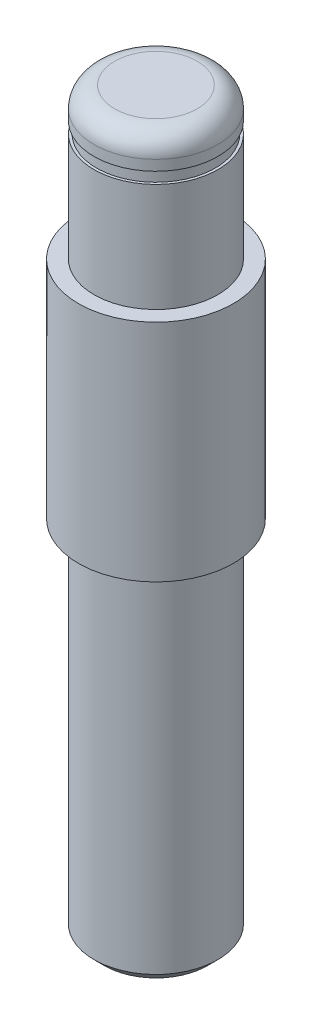
ISO-10303-21;
HEADER;
FILE_DESCRIPTION(('STEP AP214'),'2;1');
FILE_NAME('part.step','',(''),(''),'','','');
FILE_SCHEMA(('AUTOMOTIVE_DESIGN { 1 0 10303 214 1 1 1 1 }'));
ENDSEC;
DATA;
#1=APPLICATION_CONTEXT('core data for automotive mechanical design processes');
#2=APPLICATION_PROTOCOL_DEFINITION('international standard','automotive_design',2000,#1);
#3=PRODUCT_CONTEXT('',#1,'mechanical');
#4=PRODUCT('Part','Part','',(#3));
#5=PRODUCT_RELATED_PRODUCT_CATEGORY('part','',(#4));
#6=PRODUCT_DEFINITION_FORMATION('','',#4);
#7=PRODUCT_DEFINITION_CONTEXT('part definition',#1,'design');
#8=PRODUCT_DEFINITION('design','',#6,#7);
#9=PRODUCT_DEFINITION_SHAPE('','',#8);
#10=(LENGTH_UNIT() NAMED_UNIT(*) SI_UNIT(.MILLI.,.METRE.));
#11=(NAMED_UNIT(*) PLANE_ANGLE_UNIT() SI_UNIT($,.RADIAN.));
#12=(NAMED_UNIT(*) SI_UNIT($,.STERADIAN.) SOLID_ANGLE_UNIT());
#13=UNCERTAINTY_MEASURE_WITH_UNIT(LENGTH_MEASURE(1.E-05),#10,'distance_accuracy_value','');
#14=(GEOMETRIC_REPRESENTATION_CONTEXT(3) GLOBAL_UNCERTAINTY_ASSIGNED_CONTEXT((#13)) GLOBAL_UNIT_ASSIGNED_CONTEXT((#10,
#11,#12)) REPRESENTATION_CONTEXT('',''));
#15=CARTESIAN_POINT('',(0.,0.,0.));
#16=DIRECTION('',(0.,0.,1.));
#17=DIRECTION('',(1.,0.,0.));
#18=AXIS2_PLACEMENT_3D('',#15,#16,#17);
#19=CARTESIAN_POINT('',(0.,0.,0.));
#20=DIRECTION('',(0.,1.,0.));
#21=DIRECTION('',(-1.,0.,0.));
#22=AXIS2_PLACEMENT_3D('',#19,#20,#21);
#23=PLANE('',#22);
#24=CARTESIAN_POINT('',(0.,0.,0.));
#25=DIRECTION('',(0.,1.,0.));
#26=DIRECTION('',(-1.,0.,0.));
#27=AXIS2_PLACEMENT_3D('',#24,#25,#26);
#28=CIRCLE('',#27,5.);
#29=CARTESIAN_POINT('',(-5.,0.,0.));
#30=VERTEX_POINT('',#29);
#31=EDGE_CURVE('E70',#30,#30,#28,.T.);
#32=ORIENTED_EDGE('',*,*,#31,.F.);
#33=EDGE_LOOP('',(#32));
#34=FACE_BOUND('',#33,.T.);
#35=ADVANCED_FACE('F30',(#34),#23,.F.);
#36=CARTESIAN_POINT('',(4.00000000000001,71.4,0.));
#37=DIRECTION('',(0.,-1.,0.));
#38=DIRECTION('',(1.,0.,0.));
#39=AXIS2_PLACEMENT_3D('',#36,#37,#38);
#40=PLANE('',#39);
#41=CARTESIAN_POINT('',(0.,71.4,0.));
#42=DIRECTION('',(0.,1.,0.));
#43=DIRECTION('',(-1.,0.,0.));
#44=AXIS2_PLACEMENT_3D('',#41,#42,#43);
#45=CIRCLE('',#44,4.00000000000001);
#46=CARTESIAN_POINT('',(-4.00000000000001,71.4,0.));
#47=VERTEX_POINT('',#46);
#48=EDGE_CURVE('E10',#47,#47,#45,.T.);
#49=ORIENTED_EDGE('',*,*,#48,.T.);
#50=EDGE_LOOP('',(#49));
#51=FACE_BOUND('',#50,.T.);
#52=ADVANCED_FACE('F77',(#51),#40,.F.);
#53=CARTESIAN_POINT('',(0.,69.4,0.));
#54=DIRECTION('',(0.,1.,0.));
#55=DIRECTION('',(-1.,0.,0.));
#56=AXIS2_PLACEMENT_3D('',#53,#54,#55);
#57=TOROIDAL_SURFACE('',#56,4.00000000000001,2.);
#58=ORIENTED_EDGE('',*,*,#48,.F.);
#59=EDGE_LOOP('',(#58));
#60=FACE_BOUND('',#59,.T.);
#61=CARTESIAN_POINT('',(0.,69.4,0.));
#62=DIRECTION('',(0.,1.,0.));
#63=DIRECTION('',(-1.,0.,0.));
#64=AXIS2_PLACEMENT_3D('',#61,#62,#63);
#65=CIRCLE('',#64,6.00000000000001);
#66=CARTESIAN_POINT('',(-6.00000000000001,69.4,0.));
#67=VERTEX_POINT('',#66);
#68=EDGE_CURVE('E36',#67,#67,#65,.T.);
#69=ORIENTED_EDGE('',*,*,#68,.T.);
#70=EDGE_LOOP('',(#69));
#71=FACE_BOUND('',#70,.T.);
#72=ADVANCED_FACE('F81',(#60,#71),#57,.T.);
#73=CARTESIAN_POINT('',(0.,71.4,0.));
#74=DIRECTION('',(0.,1.,0.));
#75=DIRECTION('',(-1.,0.,0.));
#76=AXIS2_PLACEMENT_3D('',#73,#74,#75);
#77=CYLINDRICAL_SURFACE('',#76,6.00000000000001);
#78=ORIENTED_EDGE('',*,*,#68,.F.);
#79=EDGE_LOOP('',(#78));
#80=FACE_BOUND('',#79,.T.);
#81=CARTESIAN_POINT('',(0.,68.4,0.));
#82=DIRECTION('',(0.,1.,0.));
#83=DIRECTION('',(-1.,0.,0.));
#84=AXIS2_PLACEMENT_3D('',#81,#82,#83);
#85=CIRCLE('',#84,6.00000000000001);
#86=CARTESIAN_POINT('',(-6.00000000000001,68.4,0.));
#87=VERTEX_POINT('',#86);
#88=EDGE_CURVE('E40',#87,#87,#85,.T.);
#89=ORIENTED_EDGE('',*,*,#88,.T.);
#90=EDGE_LOOP('',(#89));
#91=FACE_BOUND('',#90,.T.);
#92=ADVANCED_FACE('F85',(#80,#91),#77,.T.);
#93=CARTESIAN_POINT('',(5.75000000000001,68.4,0.));
#94=DIRECTION('',(0.,1.,0.));
#95=DIRECTION('',(-1.,0.,0.));
#96=AXIS2_PLACEMENT_3D('',#93,#94,#95);
#97=PLANE('',#96);
#98=ORIENTED_EDGE('',*,*,#88,.F.);
#99=EDGE_LOOP('',(#98));
#100=FACE_BOUND('',#99,.T.);
#101=CARTESIAN_POINT('',(0.,68.4,0.));
#102=DIRECTION('',(0.,1.,0.));
#103=DIRECTION('',(-1.,0.,0.));
#104=AXIS2_PLACEMENT_3D('',#101,#102,#103);
#105=CIRCLE('',#104,5.75000000000001);
#106=CARTESIAN_POINT('',(-5.75000000000001,68.4,0.));
#107=VERTEX_POINT('',#106);
#108=EDGE_CURVE('E44',#107,#107,#105,.T.);
#109=ORIENTED_EDGE('',*,*,#108,.T.);
#110=EDGE_LOOP('',(#109));
#111=FACE_BOUND('',#110,.T.);
#112=ADVANCED_FACE('F91',(#100,#111),#97,.F.);
#113=CARTESIAN_POINT('',(0.,71.4,0.));
#114=DIRECTION('',(0.,1.,0.));
#115=DIRECTION('',(-1.,0.,0.));
#116=AXIS2_PLACEMENT_3D('',#113,#114,#115);
#117=CYLINDRICAL_SURFACE('',#116,5.75000000000001);
#118=ORIENTED_EDGE('',*,*,#108,.F.);
#119=EDGE_LOOP('',(#118));
#120=FACE_BOUND('',#119,.T.);
#121=CARTESIAN_POINT('',(0.,67.3,0.));
#122=DIRECTION('',(0.,1.,0.));
#123=DIRECTION('',(-1.,0.,0.));
#124=AXIS2_PLACEMENT_3D('',#121,#122,#123);
#125=CIRCLE('',#124,5.75000000000001);
#126=CARTESIAN_POINT('',(-5.75000000000001,67.3,0.));
#127=VERTEX_POINT('',#126);
#128=EDGE_CURVE('E49',#127,#127,#125,.T.);
#129=ORIENTED_EDGE('',*,*,#128,.T.);
#130=EDGE_LOOP('',(#129));
#131=FACE_BOUND('',#130,.T.);
#132=ADVANCED_FACE('F95',(#120,#131),#117,.T.);
#133=CARTESIAN_POINT('',(6.00000000000001,67.3,0.));
#134=DIRECTION('',(0.,-1.,0.));
#135=DIRECTION('',(1.,0.,0.));
#136=AXIS2_PLACEMENT_3D('',#133,#134,#135);
#137=PLANE('',#136);
#138=ORIENTED_EDGE('',*,*,#128,.F.);
#139=EDGE_LOOP('',(#138));
#140=FACE_BOUND('',#139,.T.);
#141=CARTESIAN_POINT('',(0.,67.3,0.));
#142=DIRECTION('',(0.,1.,0.));
#143=DIRECTION('',(-1.,0.,0.));
#144=AXIS2_PLACEMENT_3D('',#141,#142,#143);
#145=CIRCLE('',#144,6.00000000000001);
#146=CARTESIAN_POINT('',(-6.00000000000001,67.3,0.));
#147=VERTEX_POINT('',#146);
#148=EDGE_CURVE('E52',#147,#147,#145,.T.);
#149=ORIENTED_EDGE('',*,*,#148,.T.);
#150=EDGE_LOOP('',(#149));
#151=FACE_BOUND('',#150,.T.);
#152=ADVANCED_FACE('F99',(#140,#151),#137,.F.);
#153=CARTESIAN_POINT('',(0.,71.4,0.));
#154=DIRECTION('',(0.,1.,0.));
#155=DIRECTION('',(-1.,0.,0.));
#156=AXIS2_PLACEMENT_3D('',#153,#154,#155);
#157=CYLINDRICAL_SURFACE('',#156,6.00000000000001);
#158=ORIENTED_EDGE('',*,*,#148,.F.);
#159=EDGE_LOOP('',(#158));
#160=FACE_BOUND('',#159,.T.);
#161=CARTESIAN_POINT('',(0.,56.8,0.));
#162=DIRECTION('',(0.,1.,0.));
#163=DIRECTION('',(-1.,0.,0.));
#164=AXIS2_PLACEMENT_3D('',#161,#162,#163);
#165=CIRCLE('',#164,6.00000000000001);
#166=CARTESIAN_POINT('',(-6.00000000000001,56.8,0.));
#167=VERTEX_POINT('',#166);
#168=EDGE_CURVE('E55',#167,#167,#165,.T.);
#169=ORIENTED_EDGE('',*,*,#168,.T.);
#170=EDGE_LOOP('',(#169));
#171=FACE_BOUND('',#170,.T.);
#172=ADVANCED_FACE('F103',(#160,#171),#157,.T.);
#173=CARTESIAN_POINT('',(7.50000000000001,56.8,0.));
#174=DIRECTION('',(0.,-1.,0.));
#175=DIRECTION('',(1.,0.,0.));
#176=AXIS2_PLACEMENT_3D('',#173,#174,#175);
#177=PLANE('',#176);
#178=ORIENTED_EDGE('',*,*,#168,.F.);
#179=EDGE_LOOP('',(#178));
#180=FACE_BOUND('',#179,.T.);
#181=CARTESIAN_POINT('',(0.,56.8,0.));
#182=DIRECTION('',(0.,1.,0.));
#183=DIRECTION('',(-1.,0.,0.));
#184=AXIS2_PLACEMENT_3D('',#181,#182,#183);
#185=CIRCLE('',#184,7.5);
#186=CARTESIAN_POINT('',(-7.5,56.8,0.));
#187=VERTEX_POINT('',#186);
#188=EDGE_CURVE('E58',#187,#187,#185,.T.);
#189=ORIENTED_EDGE('',*,*,#188,.T.);
#190=EDGE_LOOP('',(#189));
#191=FACE_BOUND('',#190,.T.);
#192=ADVANCED_FACE('F107',(#180,#191),#177,.F.);
#193=CARTESIAN_POINT('',(0.,71.4,0.));
#194=DIRECTION('',(0.,1.,0.));
#195=DIRECTION('',(-1.,0.,0.));
#196=AXIS2_PLACEMENT_3D('',#193,#194,#195);
#197=CYLINDRICAL_SURFACE('',#196,7.50000000000001);
#198=ORIENTED_EDGE('',*,*,#188,.F.);
#199=EDGE_LOOP('',(#198));
#200=FACE_BOUND('',#199,.T.);
#201=CARTESIAN_POINT('',(0.,35.,0.));
#202=DIRECTION('',(0.,1.,0.));
#203=DIRECTION('',(-1.,0.,0.));
#204=AXIS2_PLACEMENT_3D('',#201,#202,#203);
#205=CIRCLE('',#204,7.50000000000001);
#206=CARTESIAN_POINT('',(-7.50000000000001,35.,0.));
#207=VERTEX_POINT('',#206);
#208=EDGE_CURVE('E61',#207,#207,#205,.T.);
#209=ORIENTED_EDGE('',*,*,#208,.T.);
#210=EDGE_LOOP('',(#209));
#211=FACE_BOUND('',#210,.T.);
#212=ADVANCED_FACE('F111',(#200,#211),#197,.T.);
#213=CARTESIAN_POINT('',(6.00000000000001,35.,0.));
#214=DIRECTION('',(0.,1.,0.));
#215=DIRECTION('',(-1.,0.,0.));
#216=AXIS2_PLACEMENT_3D('',#213,#214,#215);
#217=PLANE('',#216);
#218=ORIENTED_EDGE('',*,*,#208,.F.);
#219=EDGE_LOOP('',(#218));
#220=FACE_BOUND('',#219,.T.);
#221=CARTESIAN_POINT('',(0.,35.,0.));
#222=DIRECTION('',(0.,1.,0.));
#223=DIRECTION('',(-1.,0.,0.));
#224=AXIS2_PLACEMENT_3D('',#221,#222,#223);
#225=CIRCLE('',#224,6.00000000000001);
#226=CARTESIAN_POINT('',(-6.00000000000001,35.,0.));
#227=VERTEX_POINT('',#226);
#228=EDGE_CURVE('E64',#227,#227,#225,.T.);
#229=ORIENTED_EDGE('',*,*,#228,.T.);
#230=EDGE_LOOP('',(#229));
#231=FACE_BOUND('',#230,.T.);
#232=ADVANCED_FACE('F115',(#220,#231),#217,.F.);
#233=CARTESIAN_POINT('',(0.,71.4,0.));
#234=DIRECTION('',(0.,1.,0.));
#235=DIRECTION('',(-1.,0.,0.));
#236=AXIS2_PLACEMENT_3D('',#233,#234,#235);
#237=CYLINDRICAL_SURFACE('',#236,6.00000000000001);
#238=ORIENTED_EDGE('',*,*,#228,.F.);
#239=EDGE_LOOP('',(#238));
#240=FACE_BOUND('',#239,.T.);
#241=CARTESIAN_POINT('',(0.,1.,0.));
#242=DIRECTION('',(0.,1.,0.));
#243=DIRECTION('',(-1.,0.,0.));
#244=AXIS2_PLACEMENT_3D('',#241,#242,#243);
#245=CIRCLE('',#244,6.);
#246=CARTESIAN_POINT('',(-6.,1.,0.));
#247=VERTEX_POINT('',#246);
#248=EDGE_CURVE('E67',#247,#247,#245,.T.);
#249=ORIENTED_EDGE('',*,*,#248,.T.);
#250=EDGE_LOOP('',(#249));
#251=FACE_BOUND('',#250,.T.);
#252=ADVANCED_FACE('F119',(#240,#251),#237,.T.);
#253=CARTESIAN_POINT('',(0.,0.,0.));
#254=DIRECTION('',(0.,1.,0.));
#255=DIRECTION('',(-1.,0.,0.));
#256=AXIS2_PLACEMENT_3D('',#253,#254,#255);
#257=CONICAL_SURFACE('',#256,5.,0.785398163397448);
#258=ORIENTED_EDGE('',*,*,#248,.F.);
#259=EDGE_LOOP('',(#258));
#260=FACE_BOUND('',#259,.T.);
#261=ORIENTED_EDGE('',*,*,#31,.T.);
#262=EDGE_LOOP('',(#261));
#263=FACE_BOUND('',#262,.T.);
#264=ADVANCED_FACE('F74',(#260,#263),#257,.T.);
#265=CLOSED_SHELL('',(#35,#52,#72,#92,#112,#132,#152,#172,#192,#212,#232,#252,#264));
#266=MANIFOLD_SOLID_BREP('B2',#265);
#267=ADVANCED_BREP_SHAPE_REPRESENTATION('',(#18,#266),#14);
#268=SHAPE_DEFINITION_REPRESENTATION(#9,#267);
ENDSEC;
END-ISO-10303-21;
